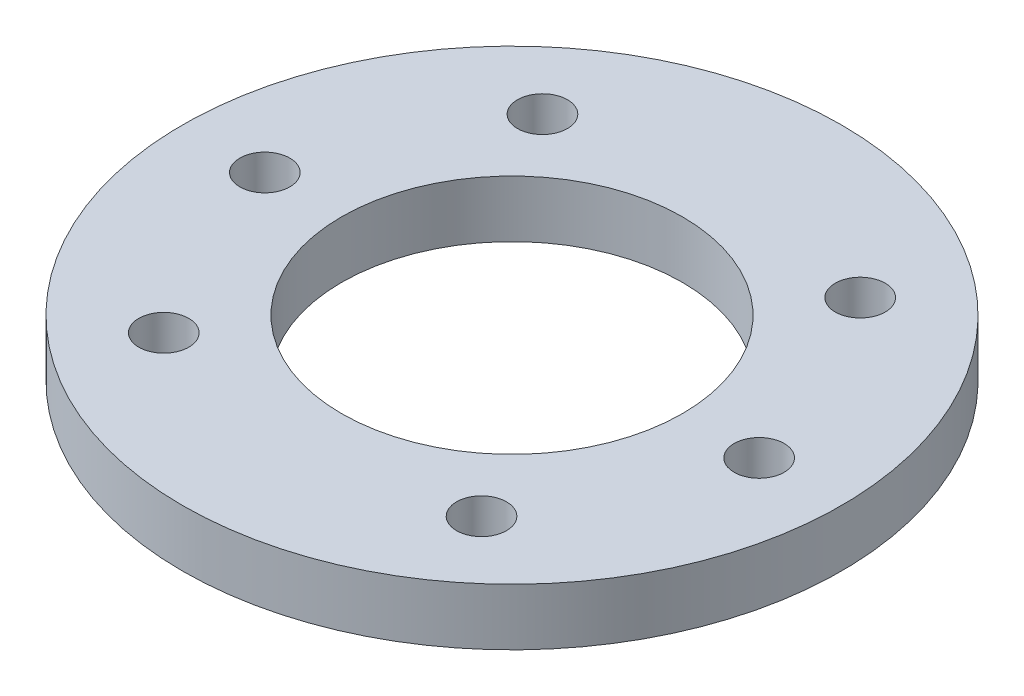
ISO-10303-21;
HEADER;
FILE_DESCRIPTION(('STEP AP214'),'2;1');
FILE_NAME('part.step','',(''),(''),'','','');
FILE_SCHEMA(('AUTOMOTIVE_DESIGN { 1 0 10303 214 1 1 1 1 }'));
ENDSEC;
DATA;
#1=APPLICATION_CONTEXT('core data for automotive mechanical design processes');
#2=APPLICATION_PROTOCOL_DEFINITION('international standard','automotive_design',2000,#1);
#3=PRODUCT_CONTEXT('',#1,'mechanical');
#4=PRODUCT('Part','Part','',(#3));
#5=PRODUCT_RELATED_PRODUCT_CATEGORY('part','',(#4));
#6=PRODUCT_DEFINITION_FORMATION('','',#4);
#7=PRODUCT_DEFINITION_CONTEXT('part definition',#1,'design');
#8=PRODUCT_DEFINITION('design','',#6,#7);
#9=PRODUCT_DEFINITION_SHAPE('','',#8);
#10=(LENGTH_UNIT() NAMED_UNIT(*) SI_UNIT(.MILLI.,.METRE.));
#11=(NAMED_UNIT(*) PLANE_ANGLE_UNIT() SI_UNIT($,.RADIAN.));
#12=(NAMED_UNIT(*) SI_UNIT($,.STERADIAN.) SOLID_ANGLE_UNIT());
#13=UNCERTAINTY_MEASURE_WITH_UNIT(LENGTH_MEASURE(1.E-05),#10,'distance_accuracy_value','');
#14=(GEOMETRIC_REPRESENTATION_CONTEXT(3) GLOBAL_UNCERTAINTY_ASSIGNED_CONTEXT((#13)) GLOBAL_UNIT_ASSIGNED_CONTEXT((#10,
#11,#12)) REPRESENTATION_CONTEXT('',''));
#15=CARTESIAN_POINT('',(0.,0.,0.));
#16=DIRECTION('',(0.,0.,1.));
#17=DIRECTION('',(1.,0.,0.));
#18=AXIS2_PLACEMENT_3D('',#15,#16,#17);
#19=CARTESIAN_POINT('',(0.,5.,0.));
#20=DIRECTION('',(0.,1.,0.));
#21=DIRECTION('',(0.,0.,1.));
#22=AXIS2_PLACEMENT_3D('',#19,#20,#21);
#23=PLANE('',#22);
#24=CARTESIAN_POINT('',(13.9806305106823,5.,16.6614666378377));
#25=DIRECTION('',(0.,1.,0.));
#26=DIRECTION('',(0.,0.,1.));
#27=AXIS2_PLACEMENT_3D('',#24,#25,#26);
#28=CIRCLE('',#27,2.2);
#29=CARTESIAN_POINT('',(13.9806305106823,5.,18.8614666378377));
#30=VERTEX_POINT('',#29);
#31=EDGE_CURVE('E77',#30,#30,#28,.T.);
#32=ORIENTED_EDGE('',*,*,#31,.F.);
#33=EDGE_LOOP('',(#32));
#34=FACE_BOUND('',#33,.T.);
#35=CARTESIAN_POINT('',(-21.75,5.,0.));
#36=DIRECTION('',(0.,1.,0.));
#37=DIRECTION('',(0.,0.,1.));
#38=AXIS2_PLACEMENT_3D('',#35,#36,#37);
#39=CIRCLE('',#38,2.2);
#40=CARTESIAN_POINT('',(-21.75,5.,2.2));
#41=VERTEX_POINT('',#40);
#42=EDGE_CURVE('E65',#41,#41,#39,.T.);
#43=ORIENTED_EDGE('',*,*,#42,.F.);
#44=EDGE_LOOP('',(#43));
#45=FACE_BOUND('',#44,.T.);
#46=CARTESIAN_POINT('',(-13.9806305106823,5.,-16.6614666378377));
#47=DIRECTION('',(0.,1.,0.));
#48=DIRECTION('',(0.,0.,1.));
#49=AXIS2_PLACEMENT_3D('',#46,#47,#48);
#50=CIRCLE('',#49,2.2);
#51=CARTESIAN_POINT('',(-13.9806305106823,5.,-14.4614666378377));
#52=VERTEX_POINT('',#51);
#53=EDGE_CURVE('E53',#52,#52,#50,.T.);
#54=ORIENTED_EDGE('',*,*,#53,.F.);
#55=EDGE_LOOP('',(#54));
#56=FACE_BOUND('',#55,.T.);
#57=CARTESIAN_POINT('',(0.,5.,0.));
#58=DIRECTION('',(0.,1.,0.));
#59=DIRECTION('',(0.,0.,1.));
#60=AXIS2_PLACEMENT_3D('',#57,#58,#59);
#61=CIRCLE('',#60,29.);
#62=CARTESIAN_POINT('',(0.,5.,29.));
#63=VERTEX_POINT('',#62);
#64=EDGE_CURVE('E10',#63,#63,#61,.T.);
#65=ORIENTED_EDGE('',*,*,#64,.T.);
#66=EDGE_LOOP('',(#65));
#67=FACE_BOUND('',#66,.T.);
#68=CARTESIAN_POINT('',(0.,5.,0.));
#69=DIRECTION('',(0.,1.,0.));
#70=DIRECTION('',(0.,0.,1.));
#71=AXIS2_PLACEMENT_3D('',#68,#69,#70);
#72=CIRCLE('',#71,15.);
#73=CARTESIAN_POINT('',(0.,5.,15.));
#74=VERTEX_POINT('',#73);
#75=EDGE_CURVE('E48',#74,#74,#72,.T.);
#76=ORIENTED_EDGE('',*,*,#75,.F.);
#77=EDGE_LOOP('',(#76));
#78=FACE_BOUND('',#77,.T.);
#79=CARTESIAN_POINT('',(13.9806305106823,5.,-16.6614666378377));
#80=DIRECTION('',(0.,1.,0.));
#81=DIRECTION('',(0.,0.,-1.));
#82=AXIS2_PLACEMENT_3D('',#79,#80,#81);
#83=CIRCLE('',#82,2.2);
#84=CARTESIAN_POINT('',(13.9806305106823,5.,-18.8614666378377));
#85=VERTEX_POINT('',#84);
#86=EDGE_CURVE('E59',#85,#85,#83,.T.);
#87=ORIENTED_EDGE('',*,*,#86,.F.);
#88=EDGE_LOOP('',(#87));
#89=FACE_BOUND('',#88,.T.);
#90=CARTESIAN_POINT('',(21.75,5.,0.));
#91=DIRECTION('',(0.,1.,0.));
#92=DIRECTION('',(0.,0.,-1.));
#93=AXIS2_PLACEMENT_3D('',#90,#91,#92);
#94=CIRCLE('',#93,2.2);
#95=CARTESIAN_POINT('',(21.75,5.,-2.2));
#96=VERTEX_POINT('',#95);
#97=EDGE_CURVE('E71',#96,#96,#94,.T.);
#98=ORIENTED_EDGE('',*,*,#97,.F.);
#99=EDGE_LOOP('',(#98));
#100=FACE_BOUND('',#99,.T.);
#101=CARTESIAN_POINT('',(-13.9806305106823,5.,16.6614666378377));
#102=DIRECTION('',(0.,1.,0.));
#103=DIRECTION('',(0.,0.,-1.));
#104=AXIS2_PLACEMENT_3D('',#101,#102,#103);
#105=CIRCLE('',#104,2.2);
#106=CARTESIAN_POINT('',(-13.9806305106823,5.,14.4614666378377));
#107=VERTEX_POINT('',#106);
#108=EDGE_CURVE('E83',#107,#107,#105,.T.);
#109=ORIENTED_EDGE('',*,*,#108,.F.);
#110=EDGE_LOOP('',(#109));
#111=FACE_BOUND('',#110,.T.);
#112=ADVANCED_FACE('F37',(#34,#45,#56,#67,#78,#89,#100,#111),#23,.T.);
#113=CARTESIAN_POINT('',(0.,0.,0.));
#114=DIRECTION('',(0.,1.,0.));
#115=DIRECTION('',(0.,0.,1.));
#116=AXIS2_PLACEMENT_3D('',#113,#114,#115);
#117=PLANE('',#116);
#118=CARTESIAN_POINT('',(0.,0.,0.));
#119=DIRECTION('',(0.,1.,0.));
#120=DIRECTION('',(0.,0.,1.));
#121=AXIS2_PLACEMENT_3D('',#118,#119,#120);
#122=CIRCLE('',#121,29.);
#123=CARTESIAN_POINT('',(0.,0.,29.));
#124=VERTEX_POINT('',#123);
#125=EDGE_CURVE('E41',#124,#124,#122,.T.);
#126=ORIENTED_EDGE('',*,*,#125,.F.);
#127=EDGE_LOOP('',(#126));
#128=FACE_BOUND('',#127,.T.);
#129=CARTESIAN_POINT('',(0.,0.,0.));
#130=DIRECTION('',(0.,1.,0.));
#131=DIRECTION('',(0.,0.,1.));
#132=AXIS2_PLACEMENT_3D('',#129,#130,#131);
#133=CIRCLE('',#132,15.);
#134=CARTESIAN_POINT('',(0.,0.,15.));
#135=VERTEX_POINT('',#134);
#136=EDGE_CURVE('E50',#135,#135,#133,.T.);
#137=ORIENTED_EDGE('',*,*,#136,.T.);
#138=EDGE_LOOP('',(#137));
#139=FACE_BOUND('',#138,.T.);
#140=CARTESIAN_POINT('',(-13.9806305106823,0.,-16.6614666378377));
#141=DIRECTION('',(0.,1.,0.));
#142=DIRECTION('',(0.,0.,1.));
#143=AXIS2_PLACEMENT_3D('',#140,#141,#142);
#144=CIRCLE('',#143,2.2);
#145=CARTESIAN_POINT('',(-13.9806305106823,0.,-14.4614666378377));
#146=VERTEX_POINT('',#145);
#147=EDGE_CURVE('E56',#146,#146,#144,.T.);
#148=ORIENTED_EDGE('',*,*,#147,.T.);
#149=EDGE_LOOP('',(#148));
#150=FACE_BOUND('',#149,.T.);
#151=CARTESIAN_POINT('',(13.9806305106823,0.,-16.6614666378377));
#152=DIRECTION('',(0.,1.,0.));
#153=DIRECTION('',(0.,0.,-1.));
#154=AXIS2_PLACEMENT_3D('',#151,#152,#153);
#155=CIRCLE('',#154,2.2);
#156=CARTESIAN_POINT('',(13.9806305106823,0.,-18.8614666378377));
#157=VERTEX_POINT('',#156);
#158=EDGE_CURVE('E62',#157,#157,#155,.T.);
#159=ORIENTED_EDGE('',*,*,#158,.T.);
#160=EDGE_LOOP('',(#159));
#161=FACE_BOUND('',#160,.T.);
#162=CARTESIAN_POINT('',(-21.75,0.,0.));
#163=DIRECTION('',(0.,1.,0.));
#164=DIRECTION('',(0.,0.,1.));
#165=AXIS2_PLACEMENT_3D('',#162,#163,#164);
#166=CIRCLE('',#165,2.2);
#167=CARTESIAN_POINT('',(-21.75,0.,2.2));
#168=VERTEX_POINT('',#167);
#169=EDGE_CURVE('E68',#168,#168,#166,.T.);
#170=ORIENTED_EDGE('',*,*,#169,.T.);
#171=EDGE_LOOP('',(#170));
#172=FACE_BOUND('',#171,.T.);
#173=CARTESIAN_POINT('',(21.75,0.,0.));
#174=DIRECTION('',(0.,1.,0.));
#175=DIRECTION('',(0.,0.,-1.));
#176=AXIS2_PLACEMENT_3D('',#173,#174,#175);
#177=CIRCLE('',#176,2.2);
#178=CARTESIAN_POINT('',(21.75,0.,-2.2));
#179=VERTEX_POINT('',#178);
#180=EDGE_CURVE('E74',#179,#179,#177,.T.);
#181=ORIENTED_EDGE('',*,*,#180,.T.);
#182=EDGE_LOOP('',(#181));
#183=FACE_BOUND('',#182,.T.);
#184=CARTESIAN_POINT('',(13.9806305106823,0.,16.6614666378377));
#185=DIRECTION('',(0.,1.,0.));
#186=DIRECTION('',(0.,0.,1.));
#187=AXIS2_PLACEMENT_3D('',#184,#185,#186);
#188=CIRCLE('',#187,2.2);
#189=CARTESIAN_POINT('',(13.9806305106823,0.,18.8614666378377));
#190=VERTEX_POINT('',#189);
#191=EDGE_CURVE('E80',#190,#190,#188,.T.);
#192=ORIENTED_EDGE('',*,*,#191,.T.);
#193=EDGE_LOOP('',(#192));
#194=FACE_BOUND('',#193,.T.);
#195=CARTESIAN_POINT('',(-13.9806305106823,0.,16.6614666378377));
#196=DIRECTION('',(0.,1.,0.));
#197=DIRECTION('',(0.,0.,-1.));
#198=AXIS2_PLACEMENT_3D('',#195,#196,#197);
#199=CIRCLE('',#198,2.2);
#200=CARTESIAN_POINT('',(-13.9806305106823,0.,14.4614666378377));
#201=VERTEX_POINT('',#200);
#202=EDGE_CURVE('E86',#201,#201,#199,.T.);
#203=ORIENTED_EDGE('',*,*,#202,.T.);
#204=EDGE_LOOP('',(#203));
#205=FACE_BOUND('',#204,.T.);
#206=ADVANCED_FACE('F96',(#128,#139,#150,#161,#172,#183,#194,#205),#117,.F.);
#207=CARTESIAN_POINT('',(0.,5.,0.));
#208=DIRECTION('',(0.,-1.,0.));
#209=DIRECTION('',(0.,0.,-1.));
#210=AXIS2_PLACEMENT_3D('',#207,#208,#209);
#211=CYLINDRICAL_SURFACE('',#210,29.);
#212=ORIENTED_EDGE('',*,*,#64,.F.);
#213=EDGE_LOOP('',(#212));
#214=FACE_BOUND('',#213,.T.);
#215=ORIENTED_EDGE('',*,*,#125,.T.);
#216=EDGE_LOOP('',(#215));
#217=FACE_BOUND('',#216,.T.);
#218=ADVANCED_FACE('F39',(#214,#217),#211,.T.);
#219=CARTESIAN_POINT('',(0.,5.,0.));
#220=DIRECTION('',(0.,-1.,0.));
#221=DIRECTION('',(0.,0.,-1.));
#222=AXIS2_PLACEMENT_3D('',#219,#220,#221);
#223=CYLINDRICAL_SURFACE('',#222,15.);
#224=ORIENTED_EDGE('',*,*,#75,.T.);
#225=EDGE_LOOP('',(#224));
#226=FACE_BOUND('',#225,.T.);
#227=ORIENTED_EDGE('',*,*,#136,.F.);
#228=EDGE_LOOP('',(#227));
#229=FACE_BOUND('',#228,.T.);
#230=ADVANCED_FACE('F106',(#226,#229),#223,.F.);
#231=CARTESIAN_POINT('',(-13.9806305106823,5.,-16.6614666378377));
#232=DIRECTION('',(0.,-1.,0.));
#233=DIRECTION('',(0.,0.,-1.));
#234=AXIS2_PLACEMENT_3D('',#231,#232,#233);
#235=CYLINDRICAL_SURFACE('',#234,2.2);
#236=ORIENTED_EDGE('',*,*,#53,.T.);
#237=EDGE_LOOP('',(#236));
#238=FACE_BOUND('',#237,.T.);
#239=ORIENTED_EDGE('',*,*,#147,.F.);
#240=EDGE_LOOP('',(#239));
#241=FACE_BOUND('',#240,.T.);
#242=ADVANCED_FACE('F109',(#238,#241),#235,.F.);
#243=CARTESIAN_POINT('',(13.9806305106823,5.,-16.6614666378377));
#244=DIRECTION('',(0.,-1.,0.));
#245=DIRECTION('',(0.,0.,-1.));
#246=AXIS2_PLACEMENT_3D('',#243,#244,#245);
#247=CYLINDRICAL_SURFACE('',#246,2.2);
#248=ORIENTED_EDGE('',*,*,#86,.T.);
#249=EDGE_LOOP('',(#248));
#250=FACE_BOUND('',#249,.T.);
#251=ORIENTED_EDGE('',*,*,#158,.F.);
#252=EDGE_LOOP('',(#251));
#253=FACE_BOUND('',#252,.T.);
#254=ADVANCED_FACE('F113',(#250,#253),#247,.F.);
#255=CARTESIAN_POINT('',(-21.75,5.,0.));
#256=DIRECTION('',(0.,-1.,0.));
#257=DIRECTION('',(0.,0.,-1.));
#258=AXIS2_PLACEMENT_3D('',#255,#256,#257);
#259=CYLINDRICAL_SURFACE('',#258,2.2);
#260=ORIENTED_EDGE('',*,*,#42,.T.);
#261=EDGE_LOOP('',(#260));
#262=FACE_BOUND('',#261,.T.);
#263=ORIENTED_EDGE('',*,*,#169,.F.);
#264=EDGE_LOOP('',(#263));
#265=FACE_BOUND('',#264,.T.);
#266=ADVANCED_FACE('F117',(#262,#265),#259,.F.);
#267=CARTESIAN_POINT('',(21.75,5.,0.));
#268=DIRECTION('',(0.,-1.,0.));
#269=DIRECTION('',(0.,0.,-1.));
#270=AXIS2_PLACEMENT_3D('',#267,#268,#269);
#271=CYLINDRICAL_SURFACE('',#270,2.2);
#272=ORIENTED_EDGE('',*,*,#97,.T.);
#273=EDGE_LOOP('',(#272));
#274=FACE_BOUND('',#273,.T.);
#275=ORIENTED_EDGE('',*,*,#180,.F.);
#276=EDGE_LOOP('',(#275));
#277=FACE_BOUND('',#276,.T.);
#278=ADVANCED_FACE('F121',(#274,#277),#271,.F.);
#279=CARTESIAN_POINT('',(13.9806305106823,5.,16.6614666378377));
#280=DIRECTION('',(0.,-1.,0.));
#281=DIRECTION('',(0.,0.,-1.));
#282=AXIS2_PLACEMENT_3D('',#279,#280,#281);
#283=CYLINDRICAL_SURFACE('',#282,2.2);
#284=ORIENTED_EDGE('',*,*,#31,.T.);
#285=EDGE_LOOP('',(#284));
#286=FACE_BOUND('',#285,.T.);
#287=ORIENTED_EDGE('',*,*,#191,.F.);
#288=EDGE_LOOP('',(#287));
#289=FACE_BOUND('',#288,.T.);
#290=ADVANCED_FACE('F125',(#286,#289),#283,.F.);
#291=CARTESIAN_POINT('',(-13.9806305106823,5.,16.6614666378377));
#292=DIRECTION('',(0.,-1.,0.));
#293=DIRECTION('',(0.,0.,-1.));
#294=AXIS2_PLACEMENT_3D('',#291,#292,#293);
#295=CYLINDRICAL_SURFACE('',#294,2.2);
#296=ORIENTED_EDGE('',*,*,#108,.T.);
#297=EDGE_LOOP('',(#296));
#298=FACE_BOUND('',#297,.T.);
#299=ORIENTED_EDGE('',*,*,#202,.F.);
#300=EDGE_LOOP('',(#299));
#301=FACE_BOUND('',#300,.T.);
#302=ADVANCED_FACE('F92',(#298,#301),#295,.F.);
#303=CLOSED_SHELL('',(#112,#206,#218,#230,#242,#254,#266,#278,#290,#302));
#304=MANIFOLD_SOLID_BREP('B2',#303);
#305=ADVANCED_BREP_SHAPE_REPRESENTATION('',(#18,#304),#14);
#306=SHAPE_DEFINITION_REPRESENTATION(#9,#305);
ENDSEC;
END-ISO-10303-21;
